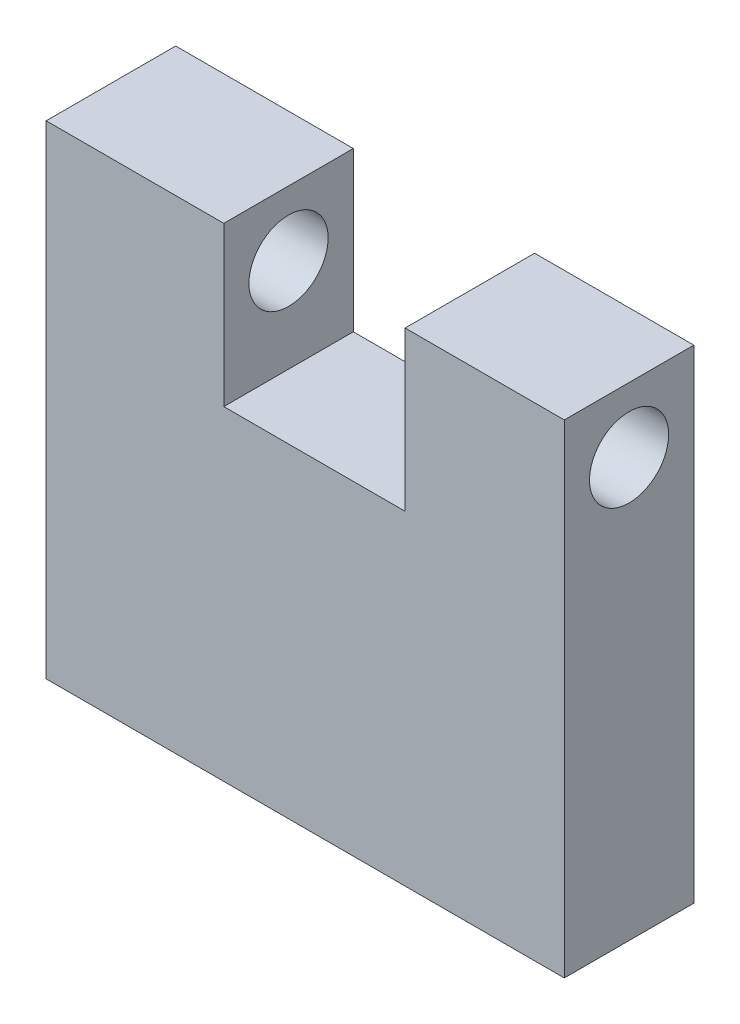
ISO-10303-21;
HEADER;
FILE_DESCRIPTION(('STEP AP214'),'2;1');
FILE_NAME('part.step','',(''),(''),'','','');
FILE_SCHEMA(('AUTOMOTIVE_DESIGN { 1 0 10303 214 1 1 1 1 }'));
ENDSEC;
DATA;
#1=APPLICATION_CONTEXT('core data for automotive mechanical design processes');
#2=APPLICATION_PROTOCOL_DEFINITION('international standard','automotive_design',2000,#1);
#3=PRODUCT_CONTEXT('',#1,'mechanical');
#4=PRODUCT('Part','Part','',(#3));
#5=PRODUCT_RELATED_PRODUCT_CATEGORY('part','',(#4));
#6=PRODUCT_DEFINITION_FORMATION('','',#4);
#7=PRODUCT_DEFINITION_CONTEXT('part definition',#1,'design');
#8=PRODUCT_DEFINITION('design','',#6,#7);
#9=PRODUCT_DEFINITION_SHAPE('','',#8);
#10=(LENGTH_UNIT() NAMED_UNIT(*) SI_UNIT(.MILLI.,.METRE.));
#11=(NAMED_UNIT(*) PLANE_ANGLE_UNIT() SI_UNIT($,.RADIAN.));
#12=(NAMED_UNIT(*) SI_UNIT($,.STERADIAN.) SOLID_ANGLE_UNIT());
#13=UNCERTAINTY_MEASURE_WITH_UNIT(LENGTH_MEASURE(1.E-05),#10,'distance_accuracy_value','');
#14=(GEOMETRIC_REPRESENTATION_CONTEXT(3) GLOBAL_UNCERTAINTY_ASSIGNED_CONTEXT((#13)) GLOBAL_UNIT_ASSIGNED_CONTEXT((#10,
#11,#12)) REPRESENTATION_CONTEXT('',''));
#15=CARTESIAN_POINT('',(0.,0.,0.));
#16=DIRECTION('',(0.,0.,1.));
#17=DIRECTION('',(1.,0.,0.));
#18=AXIS2_PLACEMENT_3D('',#15,#16,#17);
#19=CARTESIAN_POINT('',(-2.1886285591799,6.49008612987785,2.286));
#20=DIRECTION('',(0.,-1.,0.));
#21=DIRECTION('',(1.,0.,0.));
#22=AXIS2_PLACEMENT_3D('',#19,#20,#21);
#23=PLANE('',#22);
#24=DIRECTION('',(-1.,0.,0.));
#25=VECTOR('',#24,1.);
#26=CARTESIAN_POINT('',(-2.1886285591799,6.49008612987785,-2.286));
#27=LINE('',#26,#25);
#28=CARTESIAN_POINT('',(-2.1886285591799,6.49008612987785,-2.286));
#29=VERTEX_POINT('',#28);
#30=CARTESIAN_POINT('',(-8.45720215989825,6.49008612987785,-2.286));
#31=VERTEX_POINT('',#30);
#32=EDGE_CURVE('E139',#29,#31,#27,.T.);
#33=ORIENTED_EDGE('',*,*,#32,.T.);
#34=DIRECTION('',(0.,0.,-1.));
#35=VECTOR('',#34,1.);
#36=CARTESIAN_POINT('',(-8.45720215989825,6.49008612987785,2.286));
#37=LINE('',#36,#35);
#38=CARTESIAN_POINT('',(-8.45720215989825,6.49008612987785,2.286));
#39=VERTEX_POINT('',#38);
#40=EDGE_CURVE('E11',#39,#31,#37,.T.);
#41=ORIENTED_EDGE('',*,*,#40,.F.);
#42=DIRECTION('',(-1.,0.,0.));
#43=VECTOR('',#42,1.);
#44=CARTESIAN_POINT('',(-2.1886285591799,6.49008612987785,2.286));
#45=LINE('',#44,#43);
#46=CARTESIAN_POINT('',(-2.1886285591799,6.49008612987785,2.286));
#47=VERTEX_POINT('',#46);
#48=EDGE_CURVE('E162',#47,#39,#45,.T.);
#49=ORIENTED_EDGE('',*,*,#48,.F.);
#50=DIRECTION('',(0.,0.,-1.));
#51=VECTOR('',#50,1.);
#52=CARTESIAN_POINT('',(-2.1886285591799,6.49008612987785,2.286));
#53=LINE('',#52,#51);
#54=EDGE_CURVE('E135',#47,#29,#53,.T.);
#55=ORIENTED_EDGE('',*,*,#54,.T.);
#56=EDGE_LOOP('',(#33,#41,#49,#55));
#57=FACE_BOUND('',#56,.T.);
#58=ADVANCED_FACE('F36',(#57),#23,.F.);
#59=CARTESIAN_POINT('',(-8.45720215989826,-10.5695227155991,2.286));
#60=DIRECTION('',(1.,0.,0.));
#61=DIRECTION('',(0.,1.,0.));
#62=AXIS2_PLACEMENT_3D('',#59,#60,#61);
#63=PLANE('',#62);
#64=CARTESIAN_POINT('',(-8.45720215989826,4.20408612987786,0.));
#65=DIRECTION('',(1.,0.,0.));
#66=DIRECTION('',(0.,0.,-1.));
#67=AXIS2_PLACEMENT_3D('',#64,#65,#66);
#68=CIRCLE('',#67,1.397);
#69=CARTESIAN_POINT('',(-8.45720215989826,4.20408612987786,-1.397));
#70=VERTEX_POINT('',#69);
#71=EDGE_CURVE('E216',#70,#70,#68,.T.);
#72=ORIENTED_EDGE('',*,*,#71,.T.);
#73=EDGE_LOOP('',(#72));
#74=FACE_BOUND('',#73,.T.);
#75=DIRECTION('',(0.,-1.,0.));
#76=VECTOR('',#75,1.);
#77=CARTESIAN_POINT('',(-8.45720215989826,-10.5695227155991,-2.286));
#78=LINE('',#77,#76);
#79=CARTESIAN_POINT('',(-8.45720215989826,-10.5695227155991,-2.286));
#80=VERTEX_POINT('',#79);
#81=EDGE_CURVE('E143',#31,#80,#78,.T.);
#82=ORIENTED_EDGE('',*,*,#81,.T.);
#83=DIRECTION('',(0.,0.,-1.));
#84=VECTOR('',#83,1.);
#85=CARTESIAN_POINT('',(-8.45720215989826,-10.5695227155991,2.286));
#86=LINE('',#85,#84);
#87=CARTESIAN_POINT('',(-8.45720215989826,-10.5695227155991,2.286));
#88=VERTEX_POINT('',#87);
#89=EDGE_CURVE('E46',#88,#80,#86,.T.);
#90=ORIENTED_EDGE('',*,*,#89,.F.);
#91=DIRECTION('',(0.,-1.,0.));
#92=VECTOR('',#91,1.);
#93=CARTESIAN_POINT('',(-8.45720215989826,-10.5695227155991,2.286));
#94=LINE('',#93,#92);
#95=EDGE_CURVE('E97',#39,#88,#94,.T.);
#96=ORIENTED_EDGE('',*,*,#95,.F.);
#97=ORIENTED_EDGE('',*,*,#40,.T.);
#98=EDGE_LOOP('',(#82,#90,#96,#97));
#99=FACE_BOUND('',#98,.T.);
#100=ADVANCED_FACE('F242',(#74,#99),#63,.F.);
#101=CARTESIAN_POINT('',(9.83079784010175,-10.5695227155991,2.286));
#102=DIRECTION('',(0.,1.,0.));
#103=DIRECTION('',(-1.,0.,0.));
#104=AXIS2_PLACEMENT_3D('',#101,#102,#103);
#105=PLANE('',#104);
#106=DIRECTION('',(1.,0.,0.));
#107=VECTOR('',#106,1.);
#108=CARTESIAN_POINT('',(9.83079784010175,-10.5695227155991,-2.286));
#109=LINE('',#108,#107);
#110=CARTESIAN_POINT('',(9.83079784010175,-10.5695227155991,-2.286));
#111=VERTEX_POINT('',#110);
#112=EDGE_CURVE('E147',#80,#111,#109,.T.);
#113=ORIENTED_EDGE('',*,*,#112,.T.);
#114=DIRECTION('',(0.,0.,-1.));
#115=VECTOR('',#114,1.);
#116=CARTESIAN_POINT('',(9.83079784010175,-10.5695227155991,2.286));
#117=LINE('',#116,#115);
#118=CARTESIAN_POINT('',(9.83079784010175,-10.5695227155991,2.286));
#119=VERTEX_POINT('',#118);
#120=EDGE_CURVE('E173',#119,#111,#117,.T.);
#121=ORIENTED_EDGE('',*,*,#120,.F.);
#122=DIRECTION('',(1.,0.,0.));
#123=VECTOR('',#122,1.);
#124=CARTESIAN_POINT('',(9.83079784010175,-10.5695227155991,2.286));
#125=LINE('',#124,#123);
#126=EDGE_CURVE('E185',#88,#119,#125,.T.);
#127=ORIENTED_EDGE('',*,*,#126,.F.);
#128=ORIENTED_EDGE('',*,*,#89,.T.);
#129=EDGE_LOOP('',(#113,#121,#127,#128));
#130=FACE_BOUND('',#129,.T.);
#131=ADVANCED_FACE('F183',(#130),#105,.F.);
#132=CARTESIAN_POINT('',(9.83079784010175,-10.5695227155991,2.286));
#133=DIRECTION('',(-1.,0.,0.));
#134=DIRECTION('',(0.,0.,1.));
#135=AXIS2_PLACEMENT_3D('',#132,#133,#134);
#136=PLANE('',#135);
#137=CARTESIAN_POINT('',(9.83079784010175,4.20408612987786,0.));
#138=DIRECTION('',(1.,0.,0.));
#139=DIRECTION('',(0.,0.,-1.));
#140=AXIS2_PLACEMENT_3D('',#137,#138,#139);
#141=CIRCLE('',#140,1.397);
#142=CARTESIAN_POINT('',(9.83079784010175,4.20408612987786,-1.397));
#143=VERTEX_POINT('',#142);
#144=EDGE_CURVE('E212',#143,#143,#141,.T.);
#145=ORIENTED_EDGE('',*,*,#144,.F.);
#146=EDGE_LOOP('',(#145));
#147=FACE_BOUND('',#146,.T.);
#148=DIRECTION('',(0.,1.,0.));
#149=VECTOR('',#148,1.);
#150=CARTESIAN_POINT('',(9.83079784010175,-10.5695227155991,-2.286));
#151=LINE('',#150,#149);
#152=CARTESIAN_POINT('',(9.83079784010175,6.49008612987786,-2.286));
#153=VERTEX_POINT('',#152);
#154=EDGE_CURVE('E150',#111,#153,#151,.T.);
#155=ORIENTED_EDGE('',*,*,#154,.T.);
#156=DIRECTION('',(0.,0.,-1.));
#157=VECTOR('',#156,1.);
#158=CARTESIAN_POINT('',(9.83079784010175,6.49008612987786,2.286));
#159=LINE('',#158,#157);
#160=CARTESIAN_POINT('',(9.83079784010175,6.49008612987786,2.286));
#161=VERTEX_POINT('',#160);
#162=EDGE_CURVE('E169',#161,#153,#159,.T.);
#163=ORIENTED_EDGE('',*,*,#162,.F.);
#164=DIRECTION('',(0.,1.,0.));
#165=VECTOR('',#164,1.);
#166=CARTESIAN_POINT('',(9.83079784010175,-10.5695227155991,2.286));
#167=LINE('',#166,#165);
#168=EDGE_CURVE('E198',#119,#161,#167,.T.);
#169=ORIENTED_EDGE('',*,*,#168,.F.);
#170=ORIENTED_EDGE('',*,*,#120,.T.);
#171=EDGE_LOOP('',(#155,#163,#169,#170));
#172=FACE_BOUND('',#171,.T.);
#173=ADVANCED_FACE('F193',(#147,#172),#136,.F.);
#174=CARTESIAN_POINT('',(9.83079784010175,6.49008612987786,2.286));
#175=DIRECTION('',(0.,-1.,0.));
#176=DIRECTION('',(1.,0.,0.));
#177=AXIS2_PLACEMENT_3D('',#174,#175,#176);
#178=PLANE('',#177);
#179=DIRECTION('',(-1.,0.,0.));
#180=VECTOR('',#179,1.);
#181=CARTESIAN_POINT('',(9.83079784010175,6.49008612987786,-2.286));
#182=LINE('',#181,#180);
#183=CARTESIAN_POINT('',(4.21117309814378,6.49008612987785,-2.286));
#184=VERTEX_POINT('',#183);
#185=EDGE_CURVE('E153',#153,#184,#182,.T.);
#186=ORIENTED_EDGE('',*,*,#185,.T.);
#187=DIRECTION('',(0.,0.,-1.));
#188=VECTOR('',#187,1.);
#189=CARTESIAN_POINT('',(4.21117309814378,6.49008612987785,2.286));
#190=LINE('',#189,#188);
#191=CARTESIAN_POINT('',(4.21117309814378,6.49008612987785,2.286));
#192=VERTEX_POINT('',#191);
#193=EDGE_CURVE('E127',#192,#184,#190,.T.);
#194=ORIENTED_EDGE('',*,*,#193,.F.);
#195=DIRECTION('',(-1.,0.,0.));
#196=VECTOR('',#195,1.);
#197=CARTESIAN_POINT('',(9.83079784010175,6.49008612987786,2.286));
#198=LINE('',#197,#196);
#199=EDGE_CURVE('E116',#161,#192,#198,.T.);
#200=ORIENTED_EDGE('',*,*,#199,.F.);
#201=ORIENTED_EDGE('',*,*,#162,.T.);
#202=EDGE_LOOP('',(#186,#194,#200,#201));
#203=FACE_BOUND('',#202,.T.);
#204=ADVANCED_FACE('F196',(#203),#178,.F.);
#205=CARTESIAN_POINT('',(4.21117309814378,0.887867873785808,2.286));
#206=DIRECTION('',(1.,0.,0.));
#207=DIRECTION('',(0.,1.,0.));
#208=AXIS2_PLACEMENT_3D('',#205,#206,#207);
#209=PLANE('',#208);
#210=CARTESIAN_POINT('',(4.21117309814378,4.20408612987786,0.));
#211=DIRECTION('',(1.,0.,0.));
#212=DIRECTION('',(0.,1.,0.));
#213=AXIS2_PLACEMENT_3D('',#210,#211,#212);
#214=CIRCLE('',#213,1.397);
#215=CARTESIAN_POINT('',(4.21117309814378,5.60108612987786,0.));
#216=VERTEX_POINT('',#215);
#217=EDGE_CURVE('E144',#216,#216,#214,.T.);
#218=ORIENTED_EDGE('',*,*,#217,.T.);
#219=EDGE_LOOP('',(#218));
#220=FACE_BOUND('',#219,.T.);
#221=DIRECTION('',(0.,-1.,0.));
#222=VECTOR('',#221,1.);
#223=CARTESIAN_POINT('',(4.21117309814378,0.887867873785808,-2.286));
#224=LINE('',#223,#222);
#225=CARTESIAN_POINT('',(4.21117309814378,0.887867873785808,-2.286));
#226=VERTEX_POINT('',#225);
#227=EDGE_CURVE('E125',#184,#226,#224,.T.);
#228=ORIENTED_EDGE('',*,*,#227,.T.);
#229=DIRECTION('',(0.,0.,-1.));
#230=VECTOR('',#229,1.);
#231=CARTESIAN_POINT('',(4.21117309814378,0.887867873785808,2.286));
#232=LINE('',#231,#230);
#233=CARTESIAN_POINT('',(4.21117309814378,0.887867873785808,2.286));
#234=VERTEX_POINT('',#233);
#235=EDGE_CURVE('E122',#234,#226,#232,.T.);
#236=ORIENTED_EDGE('',*,*,#235,.F.);
#237=DIRECTION('',(0.,-1.,0.));
#238=VECTOR('',#237,1.);
#239=CARTESIAN_POINT('',(4.21117309814378,0.887867873785808,2.286));
#240=LINE('',#239,#238);
#241=EDGE_CURVE('E110',#192,#234,#240,.T.);
#242=ORIENTED_EDGE('',*,*,#241,.F.);
#243=ORIENTED_EDGE('',*,*,#193,.T.);
#244=EDGE_LOOP('',(#228,#236,#242,#243));
#245=FACE_BOUND('',#244,.T.);
#246=ADVANCED_FACE('F123',(#220,#245),#209,.F.);
#247=CARTESIAN_POINT('',(-2.1886285591799,0.887867873785808,2.286));
#248=DIRECTION('',(0.,-1.,0.));
#249=DIRECTION('',(0.,0.,-1.));
#250=AXIS2_PLACEMENT_3D('',#247,#248,#249);
#251=PLANE('',#250);
#252=DIRECTION('',(-1.,0.,0.));
#253=VECTOR('',#252,1.);
#254=CARTESIAN_POINT('',(-2.1886285591799,0.887867873785808,-2.286));
#255=LINE('',#254,#253);
#256=CARTESIAN_POINT('',(-2.1886285591799,0.887867873785808,-2.286));
#257=VERTEX_POINT('',#256);
#258=EDGE_CURVE('E83',#226,#257,#255,.T.);
#259=ORIENTED_EDGE('',*,*,#258,.T.);
#260=DIRECTION('',(0.,0.,-1.));
#261=VECTOR('',#260,1.);
#262=CARTESIAN_POINT('',(-2.1886285591799,0.887867873785808,2.286));
#263=LINE('',#262,#261);
#264=CARTESIAN_POINT('',(-2.1886285591799,0.887867873785808,2.286));
#265=VERTEX_POINT('',#264);
#266=EDGE_CURVE('E128',#265,#257,#263,.T.);
#267=ORIENTED_EDGE('',*,*,#266,.F.);
#268=DIRECTION('',(-1.,0.,0.));
#269=VECTOR('',#268,1.);
#270=CARTESIAN_POINT('',(-2.1886285591799,0.887867873785808,2.286));
#271=LINE('',#270,#269);
#272=EDGE_CURVE('E114',#234,#265,#271,.T.);
#273=ORIENTED_EDGE('',*,*,#272,.F.);
#274=ORIENTED_EDGE('',*,*,#235,.T.);
#275=EDGE_LOOP('',(#259,#267,#273,#274));
#276=FACE_BOUND('',#275,.T.);
#277=ADVANCED_FACE('F130',(#276),#251,.F.);
#278=CARTESIAN_POINT('',(-2.1886285591799,6.49008612987785,2.286));
#279=DIRECTION('',(-1.,0.,0.));
#280=DIRECTION('',(0.,0.,1.));
#281=AXIS2_PLACEMENT_3D('',#278,#279,#280);
#282=PLANE('',#281);
#283=CARTESIAN_POINT('',(-2.1886285591799,4.20408612987786,0.));
#284=DIRECTION('',(-1.,0.,0.));
#285=DIRECTION('',(0.,0.,1.));
#286=AXIS2_PLACEMENT_3D('',#283,#284,#285);
#287=CIRCLE('',#286,1.397);
#288=CARTESIAN_POINT('',(-2.1886285591799,4.20408612987786,1.397));
#289=VERTEX_POINT('',#288);
#290=EDGE_CURVE('E39',#289,#289,#287,.T.);
#291=ORIENTED_EDGE('',*,*,#290,.T.);
#292=EDGE_LOOP('',(#291));
#293=FACE_BOUND('',#292,.T.);
#294=DIRECTION('',(0.,1.,0.));
#295=VECTOR('',#294,1.);
#296=CARTESIAN_POINT('',(-2.1886285591799,6.49008612987785,-2.286));
#297=LINE('',#296,#295);
#298=EDGE_CURVE('E89',#257,#29,#297,.T.);
#299=ORIENTED_EDGE('',*,*,#298,.T.);
#300=ORIENTED_EDGE('',*,*,#54,.F.);
#301=DIRECTION('',(0.,1.,0.));
#302=VECTOR('',#301,1.);
#303=CARTESIAN_POINT('',(-2.1886285591799,6.49008612987785,2.286));
#304=LINE('',#303,#302);
#305=EDGE_CURVE('E54',#265,#47,#304,.T.);
#306=ORIENTED_EDGE('',*,*,#305,.F.);
#307=ORIENTED_EDGE('',*,*,#266,.T.);
#308=EDGE_LOOP('',(#299,#300,#306,#307));
#309=FACE_BOUND('',#308,.T.);
#310=ADVANCED_FACE('F227',(#293,#309),#282,.F.);
#311=CARTESIAN_POINT('',(0.,0.,2.286));
#312=DIRECTION('',(0.,0.,-1.));
#313=DIRECTION('',(-1.,0.,0.));
#314=AXIS2_PLACEMENT_3D('',#311,#312,#313);
#315=PLANE('',#314);
#316=ORIENTED_EDGE('',*,*,#48,.T.);
#317=ORIENTED_EDGE('',*,*,#95,.T.);
#318=ORIENTED_EDGE('',*,*,#126,.T.);
#319=ORIENTED_EDGE('',*,*,#168,.T.);
#320=ORIENTED_EDGE('',*,*,#199,.T.);
#321=ORIENTED_EDGE('',*,*,#241,.T.);
#322=ORIENTED_EDGE('',*,*,#272,.T.);
#323=ORIENTED_EDGE('',*,*,#305,.T.);
#324=EDGE_LOOP('',(#316,#317,#318,#319,#320,#321,#322,#323));
#325=FACE_BOUND('',#324,.T.);
#326=ADVANCED_FACE('F112',(#325),#315,.F.);
#327=CARTESIAN_POINT('',(0.,0.,-2.286));
#328=DIRECTION('',(0.,0.,-1.));
#329=DIRECTION('',(-1.,0.,0.));
#330=AXIS2_PLACEMENT_3D('',#327,#328,#329);
#331=PLANE('',#330);
#332=ORIENTED_EDGE('',*,*,#32,.F.);
#333=ORIENTED_EDGE('',*,*,#298,.F.);
#334=ORIENTED_EDGE('',*,*,#258,.F.);
#335=ORIENTED_EDGE('',*,*,#227,.F.);
#336=ORIENTED_EDGE('',*,*,#185,.F.);
#337=ORIENTED_EDGE('',*,*,#154,.F.);
#338=ORIENTED_EDGE('',*,*,#112,.F.);
#339=ORIENTED_EDGE('',*,*,#81,.F.);
#340=EDGE_LOOP('',(#332,#333,#334,#335,#336,#337,#338,#339));
#341=FACE_BOUND('',#340,.T.);
#342=ADVANCED_FACE('F189',(#341),#331,.T.);
#343=CARTESIAN_POINT('',(-8.45720215989826,4.20408612987786,0.));
#344=DIRECTION('',(1.,0.,0.));
#345=DIRECTION('',(0.,0.,-1.));
#346=AXIS2_PLACEMENT_3D('',#343,#344,#345);
#347=CYLINDRICAL_SURFACE('',#346,1.397);
#348=ORIENTED_EDGE('',*,*,#71,.F.);
#349=EDGE_LOOP('',(#348));
#350=FACE_BOUND('',#349,.T.);
#351=ORIENTED_EDGE('',*,*,#290,.F.);
#352=EDGE_LOOP('',(#351));
#353=FACE_BOUND('',#352,.T.);
#354=ADVANCED_FACE('F229',(#350,#353),#347,.F.);
#355=ORIENTED_EDGE('',*,*,#144,.T.);
#356=EDGE_LOOP('',(#355));
#357=FACE_BOUND('',#356,.T.);
#358=ORIENTED_EDGE('',*,*,#217,.F.);
#359=EDGE_LOOP('',(#358));
#360=FACE_BOUND('',#359,.T.);
#361=ADVANCED_FACE('F231',(#357,#360),#347,.F.);
#362=CLOSED_SHELL('',(#58,#100,#131,#173,#204,#246,#277,#310,#326,#342,#354,#361));
#363=MANIFOLD_SOLID_BREP('B2',#362);
#364=ADVANCED_BREP_SHAPE_REPRESENTATION('',(#18,#363),#14);
#365=SHAPE_DEFINITION_REPRESENTATION(#9,#364);
ENDSEC;
END-ISO-10303-21;
